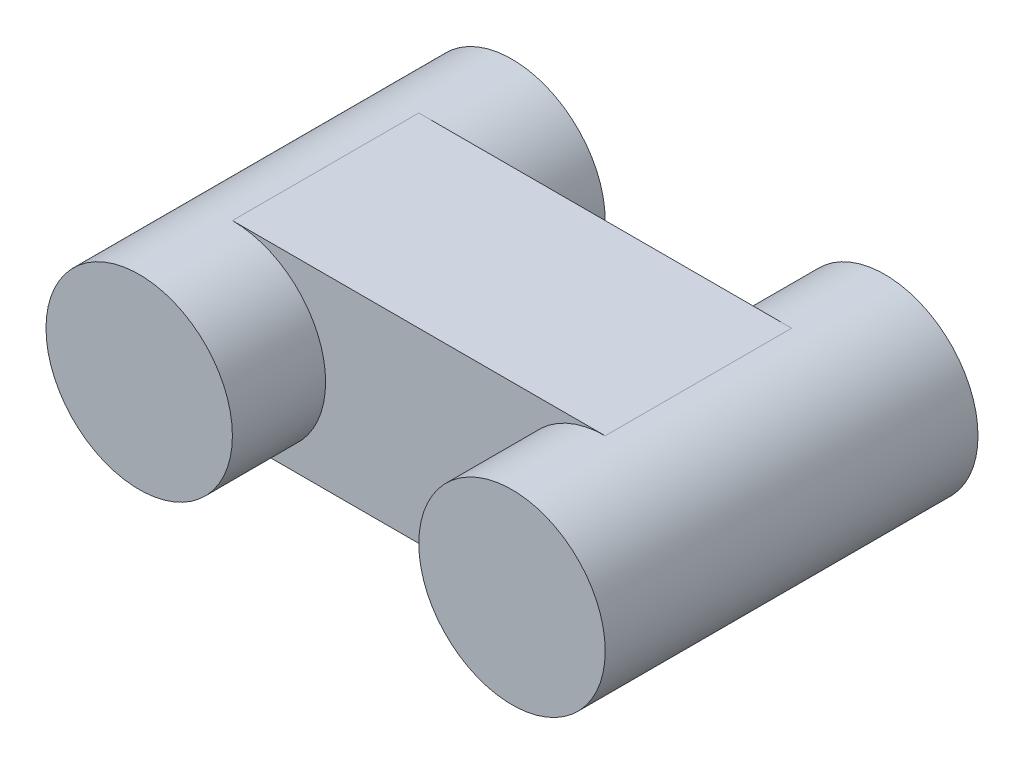
ISO-10303-21;
HEADER;
FILE_DESCRIPTION(('STEP AP214'),'2;1');
FILE_NAME('part.step','',(''),(''),'','','');
FILE_SCHEMA(('AUTOMOTIVE_DESIGN { 1 0 10303 214 1 1 1 1 }'));
ENDSEC;
DATA;
#1=APPLICATION_CONTEXT('core data for automotive mechanical design processes');
#2=APPLICATION_PROTOCOL_DEFINITION('international standard','automotive_design',2000,#1);
#3=PRODUCT_CONTEXT('',#1,'mechanical');
#4=PRODUCT('Part','Part','',(#3));
#5=PRODUCT_RELATED_PRODUCT_CATEGORY('part','',(#4));
#6=PRODUCT_DEFINITION_FORMATION('','',#4);
#7=PRODUCT_DEFINITION_CONTEXT('part definition',#1,'design');
#8=PRODUCT_DEFINITION('design','',#6,#7);
#9=PRODUCT_DEFINITION_SHAPE('','',#8);
#10=(LENGTH_UNIT() NAMED_UNIT(*) SI_UNIT(.MILLI.,.METRE.));
#11=(NAMED_UNIT(*) PLANE_ANGLE_UNIT() SI_UNIT($,.RADIAN.));
#12=(NAMED_UNIT(*) SI_UNIT($,.STERADIAN.) SOLID_ANGLE_UNIT());
#13=UNCERTAINTY_MEASURE_WITH_UNIT(LENGTH_MEASURE(1.E-05),#10,'distance_accuracy_value','');
#14=(GEOMETRIC_REPRESENTATION_CONTEXT(3) GLOBAL_UNCERTAINTY_ASSIGNED_CONTEXT((#13)) GLOBAL_UNIT_ASSIGNED_CONTEXT((#10,
#11,#12)) REPRESENTATION_CONTEXT('',''));
#15=CARTESIAN_POINT('',(0.,0.,0.));
#16=DIRECTION('',(0.,0.,1.));
#17=DIRECTION('',(1.,0.,0.));
#18=AXIS2_PLACEMENT_3D('',#15,#16,#17);
#19=CARTESIAN_POINT('',(0.,0.,-2.));
#20=DIRECTION('',(0.,0.,1.));
#21=DIRECTION('',(1.,0.,0.));
#22=AXIS2_PLACEMENT_3D('',#19,#20,#21);
#23=CYLINDRICAL_SURFACE('',#22,1.);
#24=DIRECTION('',(0.,0.,1.));
#25=VECTOR('',#24,1.);
#26=CARTESIAN_POINT('',(0.,-1.,-2.));
#27=LINE('',#26,#25);
#28=CARTESIAN_POINT('',(0.,-1.,-2.));
#29=VERTEX_POINT('',#28);
#30=CARTESIAN_POINT('',(0.,-1.,0.));
#31=VERTEX_POINT('',#30);
#32=EDGE_CURVE('E107',#29,#31,#27,.T.);
#33=ORIENTED_EDGE('',*,*,#32,.T.);
#34=CARTESIAN_POINT('',(0.,0.,0.));
#35=DIRECTION('',(0.,0.,1.));
#36=DIRECTION('',(1.,0.,0.));
#37=AXIS2_PLACEMENT_3D('',#34,#35,#36);
#38=CIRCLE('',#37,1.);
#39=CARTESIAN_POINT('',(0.,1.,0.));
#40=VERTEX_POINT('',#39);
#41=EDGE_CURVE('E43',#31,#40,#38,.T.);
#42=ORIENTED_EDGE('',*,*,#41,.T.);
#43=DIRECTION('',(0.,0.,1.));
#44=VECTOR('',#43,1.);
#45=CARTESIAN_POINT('',(0.,1.,-2.));
#46=LINE('',#45,#44);
#47=CARTESIAN_POINT('',(0.,1.,-2.));
#48=VERTEX_POINT('',#47);
#49=EDGE_CURVE('E83',#48,#40,#46,.T.);
#50=ORIENTED_EDGE('',*,*,#49,.F.);
#51=CARTESIAN_POINT('',(0.,0.,-2.));
#52=DIRECTION('',(0.,0.,1.));
#53=DIRECTION('',(1.,0.,0.));
#54=AXIS2_PLACEMENT_3D('',#51,#52,#53);
#55=CIRCLE('',#54,1.);
#56=EDGE_CURVE('E51',#29,#48,#55,.T.);
#57=ORIENTED_EDGE('',*,*,#56,.F.);
#58=EDGE_LOOP('',(#33,#42,#50,#57));
#59=FACE_BOUND('',#58,.T.);
#60=CARTESIAN_POINT('',(0.,0.,1.));
#61=DIRECTION('',(0.,0.,1.));
#62=DIRECTION('',(1.,0.,0.));
#63=AXIS2_PLACEMENT_3D('',#60,#61,#62);
#64=CIRCLE('',#63,1.);
#65=CARTESIAN_POINT('',(1.,0.,1.));
#66=VERTEX_POINT('',#65);
#67=EDGE_CURVE('E115',#66,#66,#64,.T.);
#68=ORIENTED_EDGE('',*,*,#67,.F.);
#69=EDGE_LOOP('',(#68));
#70=FACE_BOUND('',#69,.T.);
#71=CARTESIAN_POINT('',(0.,0.,-3.));
#72=DIRECTION('',(0.,0.,1.));
#73=DIRECTION('',(1.,0.,0.));
#74=AXIS2_PLACEMENT_3D('',#71,#72,#73);
#75=CIRCLE('',#74,1.);
#76=CARTESIAN_POINT('',(1.,0.,-3.));
#77=VERTEX_POINT('',#76);
#78=EDGE_CURVE('E99',#77,#77,#75,.T.);
#79=ORIENTED_EDGE('',*,*,#78,.T.);
#80=EDGE_LOOP('',(#79));
#81=FACE_BOUND('',#80,.T.);
#82=ADVANCED_FACE('F35',(#59,#70,#81),#23,.T.);
#83=CARTESIAN_POINT('',(0.,1.,-2.));
#84=DIRECTION('',(0.,-1.,0.));
#85=DIRECTION('',(0.,0.,-1.));
#86=AXIS2_PLACEMENT_3D('',#83,#84,#85);
#87=PLANE('',#86);
#88=DIRECTION('',(1.,0.,0.));
#89=VECTOR('',#88,1.);
#90=CARTESIAN_POINT('',(0.,1.,0.));
#91=LINE('',#90,#89);
#92=CARTESIAN_POINT('',(4.,1.,0.));
#93=VERTEX_POINT('',#92);
#94=EDGE_CURVE('E78',#40,#93,#91,.T.);
#95=ORIENTED_EDGE('',*,*,#94,.T.);
#96=DIRECTION('',(0.,0.,1.));
#97=VECTOR('',#96,1.);
#98=CARTESIAN_POINT('',(4.,1.,-2.));
#99=LINE('',#98,#97);
#100=CARTESIAN_POINT('',(4.,1.,-2.));
#101=VERTEX_POINT('',#100);
#102=EDGE_CURVE('E82',#101,#93,#99,.T.);
#103=ORIENTED_EDGE('',*,*,#102,.F.);
#104=DIRECTION('',(1.,0.,0.));
#105=VECTOR('',#104,1.);
#106=CARTESIAN_POINT('',(0.,1.,-2.));
#107=LINE('',#106,#105);
#108=EDGE_CURVE('E102',#48,#101,#107,.T.);
#109=ORIENTED_EDGE('',*,*,#108,.F.);
#110=ORIENTED_EDGE('',*,*,#49,.T.);
#111=EDGE_LOOP('',(#95,#103,#109,#110));
#112=FACE_BOUND('',#111,.T.);
#113=ADVANCED_FACE('F80',(#112),#87,.F.);
#114=CARTESIAN_POINT('',(4.,0.,-2.));
#115=DIRECTION('',(0.,0.,1.));
#116=DIRECTION('',(1.,0.,0.));
#117=AXIS2_PLACEMENT_3D('',#114,#115,#116);
#118=CYLINDRICAL_SURFACE('',#117,1.);
#119=ORIENTED_EDGE('',*,*,#102,.T.);
#120=CARTESIAN_POINT('',(4.,0.,0.));
#121=DIRECTION('',(0.,0.,1.));
#122=DIRECTION('',(1.,0.,0.));
#123=AXIS2_PLACEMENT_3D('',#120,#121,#122);
#124=CIRCLE('',#123,1.);
#125=CARTESIAN_POINT('',(4.,-1.,0.));
#126=VERTEX_POINT('',#125);
#127=EDGE_CURVE('E11',#93,#126,#124,.T.);
#128=ORIENTED_EDGE('',*,*,#127,.T.);
#129=DIRECTION('',(0.,0.,1.));
#130=VECTOR('',#129,1.);
#131=CARTESIAN_POINT('',(4.,-1.,-2.));
#132=LINE('',#131,#130);
#133=CARTESIAN_POINT('',(4.,-1.,-2.));
#134=VERTEX_POINT('',#133);
#135=EDGE_CURVE('E93',#134,#126,#132,.T.);
#136=ORIENTED_EDGE('',*,*,#135,.F.);
#137=CARTESIAN_POINT('',(4.,0.,-2.));
#138=DIRECTION('',(0.,0.,1.));
#139=DIRECTION('',(1.,0.,0.));
#140=AXIS2_PLACEMENT_3D('',#137,#138,#139);
#141=CIRCLE('',#140,1.);
#142=EDGE_CURVE('E92',#101,#134,#141,.T.);
#143=ORIENTED_EDGE('',*,*,#142,.F.);
#144=EDGE_LOOP('',(#119,#128,#136,#143));
#145=FACE_BOUND('',#144,.T.);
#146=CARTESIAN_POINT('',(4.,0.,1.));
#147=DIRECTION('',(0.,0.,1.));
#148=DIRECTION('',(1.,0.,0.));
#149=AXIS2_PLACEMENT_3D('',#146,#147,#148);
#150=CIRCLE('',#149,1.);
#151=CARTESIAN_POINT('',(5.,0.,1.));
#152=VERTEX_POINT('',#151);
#153=EDGE_CURVE('E122',#152,#152,#150,.T.);
#154=ORIENTED_EDGE('',*,*,#153,.F.);
#155=EDGE_LOOP('',(#154));
#156=FACE_BOUND('',#155,.T.);
#157=CARTESIAN_POINT('',(4.,0.,-3.));
#158=DIRECTION('',(0.,0.,1.));
#159=DIRECTION('',(1.,0.,0.));
#160=AXIS2_PLACEMENT_3D('',#157,#158,#159);
#161=CIRCLE('',#160,1.);
#162=CARTESIAN_POINT('',(5.,0.,-3.));
#163=VERTEX_POINT('',#162);
#164=EDGE_CURVE('E119',#163,#163,#161,.T.);
#165=ORIENTED_EDGE('',*,*,#164,.T.);
#166=EDGE_LOOP('',(#165));
#167=FACE_BOUND('',#166,.T.);
#168=ADVANCED_FACE('F89',(#145,#156,#167),#118,.T.);
#169=CARTESIAN_POINT('',(0.,-1.,-2.));
#170=DIRECTION('',(0.,-1.,0.));
#171=DIRECTION('',(0.,0.,-1.));
#172=AXIS2_PLACEMENT_3D('',#169,#170,#171);
#173=PLANE('',#172);
#174=DIRECTION('',(1.,0.,0.));
#175=VECTOR('',#174,1.);
#176=CARTESIAN_POINT('',(0.,-1.,0.));
#177=LINE('',#176,#175);
#178=EDGE_CURVE('E86',#31,#126,#177,.T.);
#179=ORIENTED_EDGE('',*,*,#178,.F.);
#180=ORIENTED_EDGE('',*,*,#32,.F.);
#181=DIRECTION('',(1.,0.,0.));
#182=VECTOR('',#181,1.);
#183=CARTESIAN_POINT('',(0.,-1.,-2.));
#184=LINE('',#183,#182);
#185=EDGE_CURVE('E85',#29,#134,#184,.T.);
#186=ORIENTED_EDGE('',*,*,#185,.T.);
#187=ORIENTED_EDGE('',*,*,#135,.T.);
#188=EDGE_LOOP('',(#179,#180,#186,#187));
#189=FACE_BOUND('',#188,.T.);
#190=ADVANCED_FACE('F110',(#189),#173,.T.);
#191=CARTESIAN_POINT('',(0.,0.,-2.));
#192=DIRECTION('',(0.,0.,1.));
#193=DIRECTION('',(1.,0.,0.));
#194=AXIS2_PLACEMENT_3D('',#191,#192,#193);
#195=PLANE('',#194);
#196=ORIENTED_EDGE('',*,*,#108,.T.);
#197=ORIENTED_EDGE('',*,*,#142,.T.);
#198=ORIENTED_EDGE('',*,*,#185,.F.);
#199=ORIENTED_EDGE('',*,*,#56,.T.);
#200=EDGE_LOOP('',(#196,#197,#198,#199));
#201=FACE_BOUND('',#200,.T.);
#202=ADVANCED_FACE('F111',(#201),#195,.F.);
#203=CARTESIAN_POINT('',(0.,0.,0.));
#204=DIRECTION('',(0.,0.,1.));
#205=DIRECTION('',(1.,0.,0.));
#206=AXIS2_PLACEMENT_3D('',#203,#204,#205);
#207=PLANE('',#206);
#208=ORIENTED_EDGE('',*,*,#127,.F.);
#209=ORIENTED_EDGE('',*,*,#94,.F.);
#210=ORIENTED_EDGE('',*,*,#41,.F.);
#211=ORIENTED_EDGE('',*,*,#178,.T.);
#212=EDGE_LOOP('',(#208,#209,#210,#211));
#213=FACE_BOUND('',#212,.T.);
#214=ADVANCED_FACE('F95',(#213),#207,.T.);
#215=CARTESIAN_POINT('',(0.,0.,1.));
#216=DIRECTION('',(0.,0.,1.));
#217=DIRECTION('',(1.,0.,0.));
#218=AXIS2_PLACEMENT_3D('',#215,#216,#217);
#219=PLANE('',#218);
#220=ORIENTED_EDGE('',*,*,#67,.T.);
#221=EDGE_LOOP('',(#220));
#222=FACE_BOUND('',#221,.T.);
#223=ADVANCED_FACE('F157',(#222),#219,.T.);
#224=CARTESIAN_POINT('',(0.,0.,-3.));
#225=DIRECTION('',(0.,0.,1.));
#226=DIRECTION('',(1.,0.,0.));
#227=AXIS2_PLACEMENT_3D('',#224,#225,#226);
#228=PLANE('',#227);
#229=ORIENTED_EDGE('',*,*,#78,.F.);
#230=EDGE_LOOP('',(#229));
#231=FACE_BOUND('',#230,.T.);
#232=ADVANCED_FACE('F138',(#231),#228,.F.);
#233=CARTESIAN_POINT('',(0.,0.,1.));
#234=DIRECTION('',(0.,0.,1.));
#235=DIRECTION('',(1.,0.,0.));
#236=AXIS2_PLACEMENT_3D('',#233,#234,#235);
#237=PLANE('',#236);
#238=ORIENTED_EDGE('',*,*,#153,.T.);
#239=EDGE_LOOP('',(#238));
#240=FACE_BOUND('',#239,.T.);
#241=ADVANCED_FACE('F126',(#240),#237,.T.);
#242=CARTESIAN_POINT('',(0.,0.,-3.));
#243=DIRECTION('',(0.,0.,1.));
#244=DIRECTION('',(1.,0.,0.));
#245=AXIS2_PLACEMENT_3D('',#242,#243,#244);
#246=PLANE('',#245);
#247=ORIENTED_EDGE('',*,*,#164,.F.);
#248=EDGE_LOOP('',(#247));
#249=FACE_BOUND('',#248,.T.);
#250=ADVANCED_FACE('F132',(#249),#246,.F.);
#251=CLOSED_SHELL('',(#82,#113,#168,#190,#202,#214,#223,#232,#241,#250));
#252=MANIFOLD_SOLID_BREP('B2',#251);
#253=ADVANCED_BREP_SHAPE_REPRESENTATION('',(#18,#252),#14);
#254=SHAPE_DEFINITION_REPRESENTATION(#9,#253);
ENDSEC;
END-ISO-10303-21;
